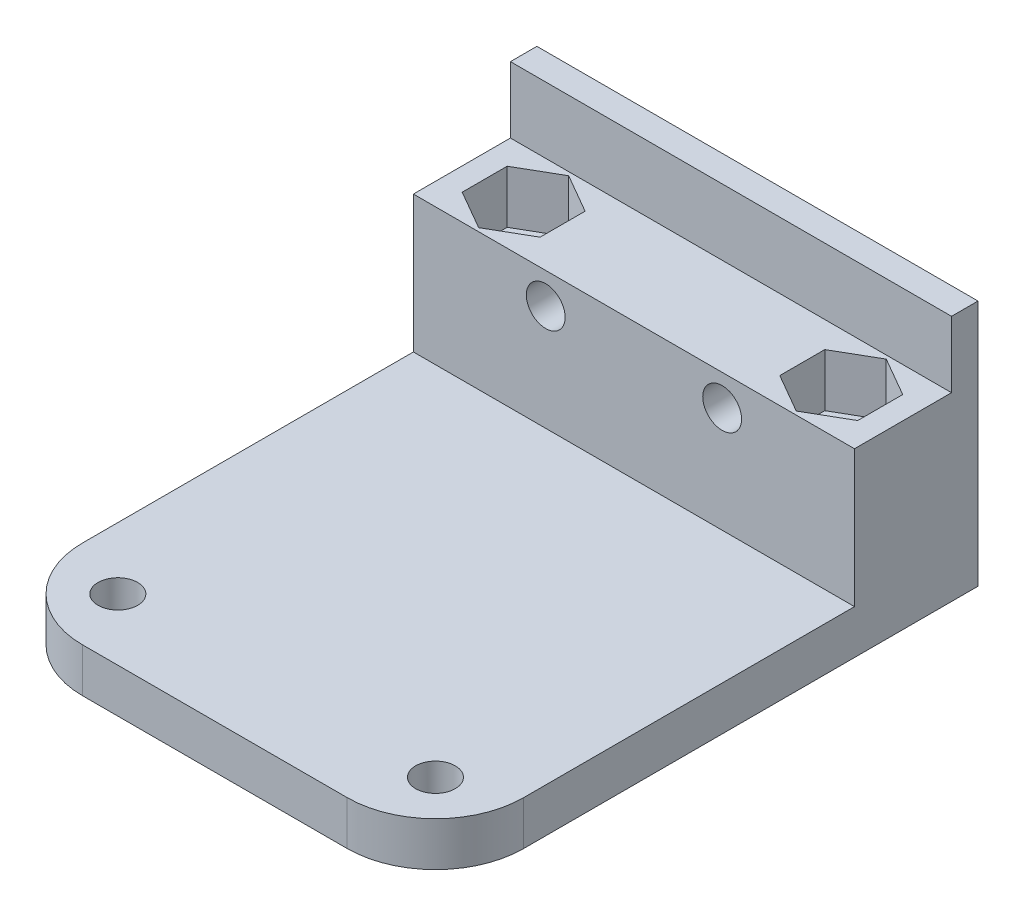
ISO-10303-21;
HEADER;
FILE_DESCRIPTION(('STEP AP214'),'2;1');
FILE_NAME('part.step','',(''),(''),'','','');
FILE_SCHEMA(('AUTOMOTIVE_DESIGN { 1 0 10303 214 1 1 1 1 }'));
ENDSEC;
DATA;
#1=APPLICATION_CONTEXT('core data for automotive mechanical design processes');
#2=APPLICATION_PROTOCOL_DEFINITION('international standard','automotive_design',2000,#1);
#3=PRODUCT_CONTEXT('',#1,'mechanical');
#4=PRODUCT('Part','Part','',(#3));
#5=PRODUCT_RELATED_PRODUCT_CATEGORY('part','',(#4));
#6=PRODUCT_DEFINITION_FORMATION('','',#4);
#7=PRODUCT_DEFINITION_CONTEXT('part definition',#1,'design');
#8=PRODUCT_DEFINITION('design','',#6,#7);
#9=PRODUCT_DEFINITION_SHAPE('','',#8);
#10=(LENGTH_UNIT() NAMED_UNIT(*) SI_UNIT(.MILLI.,.METRE.));
#11=(NAMED_UNIT(*) PLANE_ANGLE_UNIT() SI_UNIT($,.RADIAN.));
#12=(NAMED_UNIT(*) SI_UNIT($,.STERADIAN.) SOLID_ANGLE_UNIT());
#13=UNCERTAINTY_MEASURE_WITH_UNIT(LENGTH_MEASURE(1.E-05),#10,'distance_accuracy_value','');
#14=(GEOMETRIC_REPRESENTATION_CONTEXT(3) GLOBAL_UNCERTAINTY_ASSIGNED_CONTEXT((#13)) GLOBAL_UNIT_ASSIGNED_CONTEXT((#10,
#11,#12)) REPRESENTATION_CONTEXT('',''));
#15=CARTESIAN_POINT('',(0.,0.,0.));
#16=DIRECTION('',(0.,0.,1.));
#17=DIRECTION('',(1.,0.,0.));
#18=AXIS2_PLACEMENT_3D('',#15,#16,#17);
#19=CARTESIAN_POINT('',(-25.,-11.5,61.5));
#20=DIRECTION('',(0.,-1.,0.));
#21=DIRECTION('',(0.,0.,-1.));
#22=AXIS2_PLACEMENT_3D('',#19,#20,#21);
#23=PLANE('',#22);
#24=CARTESIAN_POINT('',(-18.,-11.5,54.5));
#25=DIRECTION('',(0.,-1.,0.));
#26=DIRECTION('',(0.,0.,-1.));
#27=AXIS2_PLACEMENT_3D('',#24,#25,#26);
#28=CIRCLE('',#27,2.2479);
#29=CARTESIAN_POINT('',(-18.,-11.5,52.2521));
#30=VERTEX_POINT('',#29);
#31=EDGE_CURVE('E257',#30,#30,#28,.T.);
#32=ORIENTED_EDGE('',*,*,#31,.T.);
#33=EDGE_LOOP('',(#32));
#34=FACE_BOUND('',#33,.T.);
#35=DIRECTION('',(-1.,0.,0.));
#36=VECTOR('',#35,1.);
#37=CARTESIAN_POINT('',(-25.,-11.5,61.5));
#38=LINE('',#37,#36);
#39=CARTESIAN_POINT('',(15.,-11.5,61.5));
#40=VERTEX_POINT('',#39);
#41=CARTESIAN_POINT('',(-15.,-11.5,61.5));
#42=VERTEX_POINT('',#41);
#43=EDGE_CURVE('E205',#40,#42,#38,.T.);
#44=ORIENTED_EDGE('',*,*,#43,.F.);
#45=CARTESIAN_POINT('',(15.,-11.5,51.5));
#46=DIRECTION('',(0.,-1.,0.));
#47=DIRECTION('',(0.,0.,-1.));
#48=AXIS2_PLACEMENT_3D('',#45,#46,#47);
#49=CIRCLE('',#48,10.);
#50=CARTESIAN_POINT('',(25.,-11.5,51.5));
#51=VERTEX_POINT('',#50);
#52=EDGE_CURVE('E53',#40,#51,#49,.F.);
#53=ORIENTED_EDGE('',*,*,#52,.T.);
#54=DIRECTION('',(0.,0.,-1.));
#55=VECTOR('',#54,1.);
#56=CARTESIAN_POINT('',(25.,-11.5,61.5));
#57=LINE('',#56,#55);
#58=CARTESIAN_POINT('',(25.,-11.5,14.));
#59=VERTEX_POINT('',#58);
#60=EDGE_CURVE('E215',#51,#59,#57,.T.);
#61=ORIENTED_EDGE('',*,*,#60,.T.);
#62=DIRECTION('',(1.,0.,0.));
#63=VECTOR('',#62,1.);
#64=CARTESIAN_POINT('',(-25.,-11.5,14.));
#65=LINE('',#64,#63);
#66=CARTESIAN_POINT('',(-25.,-11.5,14.));
#67=VERTEX_POINT('',#66);
#68=EDGE_CURVE('E307',#67,#59,#65,.T.);
#69=ORIENTED_EDGE('',*,*,#68,.F.);
#70=DIRECTION('',(0.,0.,-1.));
#71=VECTOR('',#70,1.);
#72=CARTESIAN_POINT('',(-25.,-11.5,61.5));
#73=LINE('',#72,#71);
#74=CARTESIAN_POINT('',(-25.,-11.5,51.5));
#75=VERTEX_POINT('',#74);
#76=EDGE_CURVE('E208',#75,#67,#73,.T.);
#77=ORIENTED_EDGE('',*,*,#76,.F.);
#78=CARTESIAN_POINT('',(-15.,-11.5,51.5));
#79=DIRECTION('',(0.,-1.,0.));
#80=DIRECTION('',(0.,0.,-1.));
#81=AXIS2_PLACEMENT_3D('',#78,#79,#80);
#82=CIRCLE('',#81,10.);
#83=EDGE_CURVE('E244',#75,#42,#82,.F.);
#84=ORIENTED_EDGE('',*,*,#83,.T.);
#85=EDGE_LOOP('',(#44,#53,#61,#69,#77,#84));
#86=FACE_BOUND('',#85,.T.);
#87=CARTESIAN_POINT('',(18.,-11.5,54.5));
#88=DIRECTION('',(0.,-1.,0.));
#89=DIRECTION('',(0.,0.,-1.));
#90=AXIS2_PLACEMENT_3D('',#87,#88,#89);
#91=CIRCLE('',#90,2.2479);
#92=CARTESIAN_POINT('',(18.,-11.5,52.2521));
#93=VERTEX_POINT('',#92);
#94=EDGE_CURVE('E260',#93,#93,#91,.T.);
#95=ORIENTED_EDGE('',*,*,#94,.T.);
#96=EDGE_LOOP('',(#95));
#97=FACE_BOUND('',#96,.T.);
#98=ADVANCED_FACE('F36',(#34,#86,#97),#23,.F.);
#99=CARTESIAN_POINT('',(-25.,16.5,3.));
#100=DIRECTION('',(1.,0.,0.));
#101=DIRECTION('',(0.,1.,0.));
#102=AXIS2_PLACEMENT_3D('',#99,#100,#101);
#103=PLANE('',#102);
#104=DIRECTION('',(0.,1.,0.));
#105=VECTOR('',#104,1.);
#106=CARTESIAN_POINT('',(-25.,-16.5,51.5));
#107=LINE('',#106,#105);
#108=CARTESIAN_POINT('',(-25.,-16.5,51.5));
#109=VERTEX_POINT('',#108);
#110=EDGE_CURVE('E240',#109,#75,#107,.T.);
#111=ORIENTED_EDGE('',*,*,#110,.T.);
#112=ORIENTED_EDGE('',*,*,#76,.T.);
#113=DIRECTION('',(0.,-1.,0.));
#114=VECTOR('',#113,1.);
#115=CARTESIAN_POINT('',(-25.,4.,14.));
#116=LINE('',#115,#114);
#117=CARTESIAN_POINT('',(-25.,4.,14.));
#118=VERTEX_POINT('',#117);
#119=EDGE_CURVE('E380',#118,#67,#116,.T.);
#120=ORIENTED_EDGE('',*,*,#119,.F.);
#121=DIRECTION('',(0.,0.,1.));
#122=VECTOR('',#121,1.);
#123=CARTESIAN_POINT('',(-25.,4.,3.));
#124=LINE('',#123,#122);
#125=CARTESIAN_POINT('',(-25.,4.,3.));
#126=VERTEX_POINT('',#125);
#127=EDGE_CURVE('E364',#126,#118,#124,.T.);
#128=ORIENTED_EDGE('',*,*,#127,.F.);
#129=DIRECTION('',(0.,-1.,0.));
#130=VECTOR('',#129,1.);
#131=CARTESIAN_POINT('',(-25.,16.5,3.));
#132=LINE('',#131,#130);
#133=CARTESIAN_POINT('',(-25.,11.5,3.));
#134=VERTEX_POINT('',#133);
#135=EDGE_CURVE('E221',#134,#126,#132,.T.);
#136=ORIENTED_EDGE('',*,*,#135,.F.);
#137=DIRECTION('',(0.,0.,1.));
#138=VECTOR('',#137,1.);
#139=CARTESIAN_POINT('',(-25.,11.5,-50.2493781056044));
#140=LINE('',#139,#138);
#141=CARTESIAN_POINT('',(-25.,11.5,0.));
#142=VERTEX_POINT('',#141);
#143=EDGE_CURVE('E206',#142,#134,#140,.T.);
#144=ORIENTED_EDGE('',*,*,#143,.F.);
#145=DIRECTION('',(0.,-1.,0.));
#146=VECTOR('',#145,1.);
#147=CARTESIAN_POINT('',(-25.,16.5,0.));
#148=LINE('',#147,#146);
#149=CARTESIAN_POINT('',(-25.,-16.5,0.));
#150=VERTEX_POINT('',#149);
#151=EDGE_CURVE('E222',#142,#150,#148,.T.);
#152=ORIENTED_EDGE('',*,*,#151,.T.);
#153=DIRECTION('',(0.,0.,-1.));
#154=VECTOR('',#153,1.);
#155=CARTESIAN_POINT('',(-25.,-16.5,3.));
#156=LINE('',#155,#154);
#157=EDGE_CURVE('E11',#109,#150,#156,.T.);
#158=ORIENTED_EDGE('',*,*,#157,.F.);
#159=EDGE_LOOP('',(#111,#112,#120,#128,#136,#144,#152,#158));
#160=FACE_BOUND('',#159,.T.);
#161=ADVANCED_FACE('F402',(#160),#103,.F.);
#162=CARTESIAN_POINT('',(-25.,-16.5,3.));
#163=DIRECTION('',(0.,1.,0.));
#164=DIRECTION('',(0.,0.,1.));
#165=AXIS2_PLACEMENT_3D('',#162,#163,#164);
#166=PLANE('',#165);
#167=CARTESIAN_POINT('',(18.,-16.5,54.5));
#168=DIRECTION('',(0.,1.,0.));
#169=DIRECTION('',(0.,0.,1.));
#170=AXIS2_PLACEMENT_3D('',#167,#168,#169);
#171=CIRCLE('',#170,2.2479);
#172=CARTESIAN_POINT('',(18.,-16.5,56.7479));
#173=VERTEX_POINT('',#172);
#174=EDGE_CURVE('E442',#173,#173,#171,.T.);
#175=ORIENTED_EDGE('',*,*,#174,.T.);
#176=EDGE_LOOP('',(#175));
#177=FACE_BOUND('',#176,.T.);
#178=DIRECTION('',(0.,0.,-1.));
#179=VECTOR('',#178,1.);
#180=CARTESIAN_POINT('',(25.,-16.5,3.));
#181=LINE('',#180,#179);
#182=CARTESIAN_POINT('',(25.,-16.5,51.5));
#183=VERTEX_POINT('',#182);
#184=CARTESIAN_POINT('',(25.,-16.5,0.));
#185=VERTEX_POINT('',#184);
#186=EDGE_CURVE('E45',#183,#185,#181,.T.);
#187=ORIENTED_EDGE('',*,*,#186,.F.);
#188=CARTESIAN_POINT('',(15.,-16.5,51.5));
#189=DIRECTION('',(0.,-1.,0.));
#190=DIRECTION('',(0.,0.,1.));
#191=AXIS2_PLACEMENT_3D('',#188,#189,#190);
#192=CIRCLE('',#191,10.);
#193=CARTESIAN_POINT('',(15.,-16.5,61.5));
#194=VERTEX_POINT('',#193);
#195=EDGE_CURVE('E186',#183,#194,#192,.T.);
#196=ORIENTED_EDGE('',*,*,#195,.T.);
#197=DIRECTION('',(1.,0.,0.));
#198=VECTOR('',#197,1.);
#199=CARTESIAN_POINT('',(-25.,-16.5,61.5));
#200=LINE('',#199,#198);
#201=CARTESIAN_POINT('',(-15.,-16.5,61.5));
#202=VERTEX_POINT('',#201);
#203=EDGE_CURVE('E199',#202,#194,#200,.T.);
#204=ORIENTED_EDGE('',*,*,#203,.F.);
#205=CARTESIAN_POINT('',(-15.,-16.5,51.5));
#206=DIRECTION('',(0.,-1.,0.));
#207=DIRECTION('',(0.,0.,1.));
#208=AXIS2_PLACEMENT_3D('',#205,#206,#207);
#209=CIRCLE('',#208,10.);
#210=EDGE_CURVE('E61',#202,#109,#209,.T.);
#211=ORIENTED_EDGE('',*,*,#210,.T.);
#212=ORIENTED_EDGE('',*,*,#157,.T.);
#213=DIRECTION('',(1.,0.,0.));
#214=VECTOR('',#213,1.);
#215=CARTESIAN_POINT('',(-25.,-16.5,0.));
#216=LINE('',#215,#214);
#217=EDGE_CURVE('E226',#150,#185,#216,.T.);
#218=ORIENTED_EDGE('',*,*,#217,.T.);
#219=EDGE_LOOP('',(#187,#196,#204,#211,#212,#218));
#220=FACE_BOUND('',#219,.T.);
#221=CARTESIAN_POINT('',(18.,-16.5,8.50000000000002));
#222=DIRECTION('',(0.,1.,0.));
#223=DIRECTION('',(0.,0.,1.));
#224=AXIS2_PLACEMENT_3D('',#221,#222,#223);
#225=CIRCLE('',#224,2.2479);
#226=CARTESIAN_POINT('',(18.,-16.5,10.7479));
#227=VERTEX_POINT('',#226);
#228=EDGE_CURVE('E448',#227,#227,#225,.T.);
#229=ORIENTED_EDGE('',*,*,#228,.T.);
#230=EDGE_LOOP('',(#229));
#231=FACE_BOUND('',#230,.T.);
#232=CARTESIAN_POINT('',(-18.,-16.5,54.5));
#233=DIRECTION('',(0.,1.,0.));
#234=DIRECTION('',(0.,0.,1.));
#235=AXIS2_PLACEMENT_3D('',#232,#233,#234);
#236=CIRCLE('',#235,2.2479);
#237=CARTESIAN_POINT('',(-18.,-16.5,56.7479));
#238=VERTEX_POINT('',#237);
#239=EDGE_CURVE('E201',#238,#238,#236,.T.);
#240=ORIENTED_EDGE('',*,*,#239,.T.);
#241=EDGE_LOOP('',(#240));
#242=FACE_BOUND('',#241,.T.);
#243=CARTESIAN_POINT('',(-18.,-16.5,8.50000000000002));
#244=DIRECTION('',(0.,1.,0.));
#245=DIRECTION('',(0.,0.,1.));
#246=AXIS2_PLACEMENT_3D('',#243,#244,#245);
#247=CIRCLE('',#246,2.2479);
#248=CARTESIAN_POINT('',(-18.,-16.5,10.7479));
#249=VERTEX_POINT('',#248);
#250=EDGE_CURVE('E444',#249,#249,#247,.T.);
#251=ORIENTED_EDGE('',*,*,#250,.T.);
#252=EDGE_LOOP('',(#251));
#253=FACE_BOUND('',#252,.T.);
#254=ADVANCED_FACE('F197',(#177,#220,#231,#242,#253),#166,.F.);
#255=CARTESIAN_POINT('',(25.,16.5,3.));
#256=DIRECTION('',(1.,0.,0.));
#257=DIRECTION('',(0.,1.,0.));
#258=AXIS2_PLACEMENT_3D('',#255,#256,#257);
#259=PLANE('',#258);
#260=ORIENTED_EDGE('',*,*,#60,.F.);
#261=DIRECTION('',(0.,1.,0.));
#262=VECTOR('',#261,1.);
#263=CARTESIAN_POINT('',(25.,-16.5,51.5));
#264=LINE('',#263,#262);
#265=EDGE_CURVE('E192',#183,#51,#264,.T.);
#266=ORIENTED_EDGE('',*,*,#265,.F.);
#267=ORIENTED_EDGE('',*,*,#186,.T.);
#268=DIRECTION('',(0.,-1.,0.));
#269=VECTOR('',#268,1.);
#270=CARTESIAN_POINT('',(25.,16.5,0.));
#271=LINE('',#270,#269);
#272=CARTESIAN_POINT('',(25.,11.5,0.));
#273=VERTEX_POINT('',#272);
#274=EDGE_CURVE('E217',#273,#185,#271,.T.);
#275=ORIENTED_EDGE('',*,*,#274,.F.);
#276=DIRECTION('',(0.,0.,1.));
#277=VECTOR('',#276,1.);
#278=CARTESIAN_POINT('',(25.,11.5,-50.2493781056044));
#279=LINE('',#278,#277);
#280=CARTESIAN_POINT('',(25.,11.5,3.));
#281=VERTEX_POINT('',#280);
#282=EDGE_CURVE('E210',#273,#281,#279,.T.);
#283=ORIENTED_EDGE('',*,*,#282,.T.);
#284=DIRECTION('',(0.,-1.,0.));
#285=VECTOR('',#284,1.);
#286=CARTESIAN_POINT('',(25.,16.5,3.));
#287=LINE('',#286,#285);
#288=CARTESIAN_POINT('',(25.,4.,3.));
#289=VERTEX_POINT('',#288);
#290=EDGE_CURVE('E218',#281,#289,#287,.T.);
#291=ORIENTED_EDGE('',*,*,#290,.T.);
#292=DIRECTION('',(0.,0.,-1.));
#293=VECTOR('',#292,1.);
#294=CARTESIAN_POINT('',(25.,4.,3.));
#295=LINE('',#294,#293);
#296=CARTESIAN_POINT('',(25.,4.,14.));
#297=VERTEX_POINT('',#296);
#298=EDGE_CURVE('E369',#297,#289,#295,.T.);
#299=ORIENTED_EDGE('',*,*,#298,.F.);
#300=DIRECTION('',(0.,-1.,0.));
#301=VECTOR('',#300,1.);
#302=CARTESIAN_POINT('',(25.,4.,14.));
#303=LINE('',#302,#301);
#304=EDGE_CURVE('E375',#297,#59,#303,.T.);
#305=ORIENTED_EDGE('',*,*,#304,.T.);
#306=EDGE_LOOP('',(#260,#266,#267,#275,#283,#291,#299,#305));
#307=FACE_BOUND('',#306,.T.);
#308=ADVANCED_FACE('F38',(#307),#259,.T.);
#309=CARTESIAN_POINT('',(0.,0.,61.5));
#310=DIRECTION('',(0.,0.,-1.));
#311=DIRECTION('',(-1.,0.,0.));
#312=AXIS2_PLACEMENT_3D('',#309,#310,#311);
#313=PLANE('',#312);
#314=DIRECTION('',(0.,1.,0.));
#315=VECTOR('',#314,1.);
#316=CARTESIAN_POINT('',(15.,-16.5,61.5));
#317=LINE('',#316,#315);
#318=EDGE_CURVE('E183',#194,#40,#317,.T.);
#319=ORIENTED_EDGE('',*,*,#318,.T.);
#320=ORIENTED_EDGE('',*,*,#43,.T.);
#321=DIRECTION('',(0.,1.,0.));
#322=VECTOR('',#321,1.);
#323=CARTESIAN_POINT('',(-15.,-16.5,61.5));
#324=LINE('',#323,#322);
#325=EDGE_CURVE('E204',#202,#42,#324,.T.);
#326=ORIENTED_EDGE('',*,*,#325,.F.);
#327=ORIENTED_EDGE('',*,*,#203,.T.);
#328=EDGE_LOOP('',(#319,#320,#326,#327));
#329=FACE_BOUND('',#328,.T.);
#330=ADVANCED_FACE('F203',(#329),#313,.F.);
#331=CARTESIAN_POINT('',(0.,0.,3.));
#332=DIRECTION('',(0.,0.,-1.));
#333=DIRECTION('',(-1.,0.,0.));
#334=AXIS2_PLACEMENT_3D('',#331,#332,#333);
#335=PLANE('',#334);
#336=ORIENTED_EDGE('',*,*,#135,.T.);
#337=DIRECTION('',(-1.,0.,0.));
#338=VECTOR('',#337,1.);
#339=CARTESIAN_POINT('',(-25.,4.,3.));
#340=LINE('',#339,#338);
#341=EDGE_CURVE('E372',#289,#126,#340,.T.);
#342=ORIENTED_EDGE('',*,*,#341,.F.);
#343=ORIENTED_EDGE('',*,*,#290,.F.);
#344=DIRECTION('',(1.,0.,0.));
#345=VECTOR('',#344,1.);
#346=CARTESIAN_POINT('',(-25.,11.5,3.));
#347=LINE('',#346,#345);
#348=EDGE_CURVE('E383',#134,#281,#347,.T.);
#349=ORIENTED_EDGE('',*,*,#348,.F.);
#350=EDGE_LOOP('',(#336,#342,#343,#349));
#351=FACE_BOUND('',#350,.T.);
#352=ADVANCED_FACE('F396',(#351),#335,.F.);
#353=CARTESIAN_POINT('',(0.,0.,0.));
#354=DIRECTION('',(0.,0.,-1.));
#355=DIRECTION('',(-1.,0.,0.));
#356=AXIS2_PLACEMENT_3D('',#353,#354,#355);
#357=PLANE('',#356);
#358=DIRECTION('',(1.,0.,0.));
#359=VECTOR('',#358,1.);
#360=CARTESIAN_POINT('',(-25.,11.5,0.));
#361=LINE('',#360,#359);
#362=EDGE_CURVE('E385',#142,#273,#361,.T.);
#363=ORIENTED_EDGE('',*,*,#362,.T.);
#364=ORIENTED_EDGE('',*,*,#274,.T.);
#365=ORIENTED_EDGE('',*,*,#217,.F.);
#366=ORIENTED_EDGE('',*,*,#151,.F.);
#367=EDGE_LOOP('',(#363,#364,#365,#366));
#368=FACE_BOUND('',#367,.T.);
#369=ADVANCED_FACE('F414',(#368),#357,.T.);
#370=CARTESIAN_POINT('',(-25.,11.5,-50.2493781056044));
#371=DIRECTION('',(0.,-1.,0.));
#372=DIRECTION('',(0.,0.,-1.));
#373=AXIS2_PLACEMENT_3D('',#370,#371,#372);
#374=PLANE('',#373);
#375=ORIENTED_EDGE('',*,*,#143,.T.);
#376=ORIENTED_EDGE('',*,*,#348,.T.);
#377=ORIENTED_EDGE('',*,*,#282,.F.);
#378=ORIENTED_EDGE('',*,*,#362,.F.);
#379=EDGE_LOOP('',(#375,#376,#377,#378));
#380=FACE_BOUND('',#379,.T.);
#381=ADVANCED_FACE('F415',(#380),#374,.F.);
#382=CARTESIAN_POINT('',(-25.,4.,14.));
#383=DIRECTION('',(0.,0.,-1.));
#384=DIRECTION('',(-1.,0.,0.));
#385=AXIS2_PLACEMENT_3D('',#382,#383,#384);
#386=PLANE('',#385);
#387=CARTESIAN_POINT('',(-10.000570113924,0.499999999999719,14.));
#388=DIRECTION('',(0.,0.,-1.));
#389=DIRECTION('',(-1.,0.,0.));
#390=AXIS2_PLACEMENT_3D('',#387,#388,#389);
#391=CIRCLE('',#390,2.2);
#392=CARTESIAN_POINT('',(-12.200570113924,0.499999999999719,14.));
#393=VERTEX_POINT('',#392);
#394=EDGE_CURVE('E234',#393,#393,#391,.F.);
#395=ORIENTED_EDGE('',*,*,#394,.F.);
#396=EDGE_LOOP('',(#395));
#397=FACE_BOUND('',#396,.T.);
#398=CARTESIAN_POINT('',(9.99942988607603,0.499999999999718,14.));
#399=DIRECTION('',(0.,0.,-1.));
#400=DIRECTION('',(-1.,0.,0.));
#401=AXIS2_PLACEMENT_3D('',#398,#399,#400);
#402=CIRCLE('',#401,2.2);
#403=CARTESIAN_POINT('',(7.79942988607602,0.499999999999718,14.));
#404=VERTEX_POINT('',#403);
#405=EDGE_CURVE('E231',#404,#404,#402,.F.);
#406=ORIENTED_EDGE('',*,*,#405,.F.);
#407=EDGE_LOOP('',(#406));
#408=FACE_BOUND('',#407,.T.);
#409=ORIENTED_EDGE('',*,*,#68,.T.);
#410=ORIENTED_EDGE('',*,*,#304,.F.);
#411=DIRECTION('',(1.,0.,0.));
#412=VECTOR('',#411,1.);
#413=CARTESIAN_POINT('',(-25.,4.,14.));
#414=LINE('',#413,#412);
#415=EDGE_CURVE('E367',#118,#297,#414,.T.);
#416=ORIENTED_EDGE('',*,*,#415,.F.);
#417=ORIENTED_EDGE('',*,*,#119,.T.);
#418=EDGE_LOOP('',(#409,#410,#416,#417));
#419=FACE_BOUND('',#418,.T.);
#420=ADVANCED_FACE('F406',(#397,#408,#419),#386,.F.);
#421=CARTESIAN_POINT('',(0.,4.,0.));
#422=DIRECTION('',(0.,1.,0.));
#423=DIRECTION('',(0.,0.,1.));
#424=AXIS2_PLACEMENT_3D('',#421,#422,#423);
#425=PLANE('',#424);
#426=DIRECTION('',(-0.866025403784439,0.,-0.499999999999999));
#427=VECTOR('',#426,1.);
#428=CARTESIAN_POINT('',(-13.5832704406994,4.,5.95000000000001));
#429=LINE('',#428,#427);
#430=CARTESIAN_POINT('',(-13.5832704406994,4.,5.95000000000001));
#431=VERTEX_POINT('',#430);
#432=CARTESIAN_POINT('',(-18.,4.,3.40000000000002));
#433=VERTEX_POINT('',#432);
#434=EDGE_CURVE('E288',#431,#433,#429,.T.);
#435=ORIENTED_EDGE('',*,*,#434,.F.);
#436=DIRECTION('',(0.,0.,-1.));
#437=VECTOR('',#436,1.);
#438=CARTESIAN_POINT('',(-13.5832704406994,4.,11.05));
#439=LINE('',#438,#437);
#440=CARTESIAN_POINT('',(-13.5832704406994,4.,11.05));
#441=VERTEX_POINT('',#440);
#442=EDGE_CURVE('E272',#441,#431,#439,.T.);
#443=ORIENTED_EDGE('',*,*,#442,.F.);
#444=DIRECTION('',(0.866025403784438,0.,-0.500000000000001));
#445=VECTOR('',#444,1.);
#446=CARTESIAN_POINT('',(-18.,4.,13.6));
#447=LINE('',#446,#445);
#448=CARTESIAN_POINT('',(-18.,4.,13.6));
#449=VERTEX_POINT('',#448);
#450=EDGE_CURVE('E300',#449,#441,#447,.T.);
#451=ORIENTED_EDGE('',*,*,#450,.F.);
#452=DIRECTION('',(0.866025403784439,0.,0.5));
#453=VECTOR('',#452,1.);
#454=CARTESIAN_POINT('',(-22.4167295593006,4.,11.05));
#455=LINE('',#454,#453);
#456=CARTESIAN_POINT('',(-22.4167295593006,4.,11.05));
#457=VERTEX_POINT('',#456);
#458=EDGE_CURVE('E297',#457,#449,#455,.T.);
#459=ORIENTED_EDGE('',*,*,#458,.F.);
#460=DIRECTION('',(0.,0.,1.));
#461=VECTOR('',#460,1.);
#462=CARTESIAN_POINT('',(-22.4167295593007,4.,5.95000000000003));
#463=LINE('',#462,#461);
#464=CARTESIAN_POINT('',(-22.4167295593007,4.,5.95000000000003));
#465=VERTEX_POINT('',#464);
#466=EDGE_CURVE('E294',#465,#457,#463,.T.);
#467=ORIENTED_EDGE('',*,*,#466,.F.);
#468=DIRECTION('',(-0.866025403784438,0.,0.500000000000001));
#469=VECTOR('',#468,1.);
#470=CARTESIAN_POINT('',(-18.,4.,3.40000000000002));
#471=LINE('',#470,#469);
#472=EDGE_CURVE('E290',#433,#465,#471,.T.);
#473=ORIENTED_EDGE('',*,*,#472,.F.);
#474=EDGE_LOOP('',(#435,#443,#451,#459,#467,#473));
#475=FACE_BOUND('',#474,.T.);
#476=DIRECTION('',(0.,0.,1.));
#477=VECTOR('',#476,1.);
#478=CARTESIAN_POINT('',(13.5832704406994,4.,11.05));
#479=LINE('',#478,#477);
#480=CARTESIAN_POINT('',(13.5832704406994,4.,5.95000000000003));
#481=VERTEX_POINT('',#480);
#482=CARTESIAN_POINT('',(13.5832704406994,4.,11.05));
#483=VERTEX_POINT('',#482);
#484=EDGE_CURVE('E237',#481,#483,#479,.T.);
#485=ORIENTED_EDGE('',*,*,#484,.F.);
#486=DIRECTION('',(-0.866025403784438,0.,0.5));
#487=VECTOR('',#486,1.);
#488=CARTESIAN_POINT('',(13.5832704406994,4.,5.95000000000003));
#489=LINE('',#488,#487);
#490=CARTESIAN_POINT('',(18.,4.,3.40000000000004));
#491=VERTEX_POINT('',#490);
#492=EDGE_CURVE('E322',#491,#481,#489,.T.);
#493=ORIENTED_EDGE('',*,*,#492,.F.);
#494=DIRECTION('',(-0.866025403784439,0.,-0.5));
#495=VECTOR('',#494,1.);
#496=CARTESIAN_POINT('',(18.,4.,3.40000000000004));
#497=LINE('',#496,#495);
#498=CARTESIAN_POINT('',(22.4167295593007,4.,5.95000000000003));
#499=VERTEX_POINT('',#498);
#500=EDGE_CURVE('E348',#499,#491,#497,.T.);
#501=ORIENTED_EDGE('',*,*,#500,.F.);
#502=DIRECTION('',(0.,0.,-1.));
#503=VECTOR('',#502,1.);
#504=CARTESIAN_POINT('',(22.4167295593007,4.,5.95000000000003));
#505=LINE('',#504,#503);
#506=CARTESIAN_POINT('',(22.4167295593007,4.,11.05));
#507=VERTEX_POINT('',#506);
#508=EDGE_CURVE('E345',#507,#499,#505,.T.);
#509=ORIENTED_EDGE('',*,*,#508,.F.);
#510=DIRECTION('',(0.866025403784439,0.,-0.499999999999999));
#511=VECTOR('',#510,1.);
#512=CARTESIAN_POINT('',(22.4167295593007,4.,11.05));
#513=LINE('',#512,#511);
#514=CARTESIAN_POINT('',(18.,4.,13.6));
#515=VERTEX_POINT('',#514);
#516=EDGE_CURVE('E342',#515,#507,#513,.T.);
#517=ORIENTED_EDGE('',*,*,#516,.F.);
#518=DIRECTION('',(0.866025403784439,0.,0.5));
#519=VECTOR('',#518,1.);
#520=CARTESIAN_POINT('',(18.,4.,13.6));
#521=LINE('',#520,#519);
#522=EDGE_CURVE('E339',#483,#515,#521,.T.);
#523=ORIENTED_EDGE('',*,*,#522,.F.);
#524=EDGE_LOOP('',(#485,#493,#501,#509,#517,#523));
#525=FACE_BOUND('',#524,.T.);
#526=ORIENTED_EDGE('',*,*,#127,.T.);
#527=ORIENTED_EDGE('',*,*,#415,.T.);
#528=ORIENTED_EDGE('',*,*,#298,.T.);
#529=ORIENTED_EDGE('',*,*,#341,.T.);
#530=EDGE_LOOP('',(#526,#527,#528,#529));
#531=FACE_BOUND('',#530,.T.);
#532=ADVANCED_FACE('F400',(#475,#525,#531),#425,.T.);
#533=CARTESIAN_POINT('',(13.5832704406994,-2.,11.05));
#534=DIRECTION('',(-1.,0.,0.));
#535=DIRECTION('',(0.,0.,1.));
#536=AXIS2_PLACEMENT_3D('',#533,#534,#535);
#537=PLANE('',#536);
#538=ORIENTED_EDGE('',*,*,#484,.T.);
#539=DIRECTION('',(0.,1.,0.));
#540=VECTOR('',#539,1.);
#541=CARTESIAN_POINT('',(13.5832704406994,-2.,11.05));
#542=LINE('',#541,#540);
#543=CARTESIAN_POINT('',(13.5832704406994,-2.,11.05));
#544=VERTEX_POINT('',#543);
#545=EDGE_CURVE('E337',#544,#483,#542,.T.);
#546=ORIENTED_EDGE('',*,*,#545,.F.);
#547=DIRECTION('',(0.,0.,1.));
#548=VECTOR('',#547,1.);
#549=CARTESIAN_POINT('',(13.5832704406994,-2.,11.05));
#550=LINE('',#549,#548);
#551=CARTESIAN_POINT('',(13.5832704406994,-2.,5.95000000000003));
#552=VERTEX_POINT('',#551);
#553=EDGE_CURVE('E318',#552,#544,#550,.T.);
#554=ORIENTED_EDGE('',*,*,#553,.F.);
#555=DIRECTION('',(0.,1.,0.));
#556=VECTOR('',#555,1.);
#557=CARTESIAN_POINT('',(13.5832704406994,-2.,5.95000000000003));
#558=LINE('',#557,#556);
#559=EDGE_CURVE('E291',#552,#481,#558,.T.);
#560=ORIENTED_EDGE('',*,*,#559,.T.);
#561=EDGE_LOOP('',(#538,#546,#554,#560));
#562=FACE_BOUND('',#561,.T.);
#563=ADVANCED_FACE('F473',(#562),#537,.F.);
#564=CARTESIAN_POINT('',(13.5832704406994,-2.,5.95000000000003));
#565=DIRECTION('',(-0.5,0.,-0.866025403784438));
#566=DIRECTION('',(-0.866025403784439,0.,0.5));
#567=AXIS2_PLACEMENT_3D('',#564,#565,#566);
#568=PLANE('',#567);
#569=ORIENTED_EDGE('',*,*,#492,.T.);
#570=ORIENTED_EDGE('',*,*,#559,.F.);
#571=DIRECTION('',(-0.866025403784438,0.,0.5));
#572=VECTOR('',#571,1.);
#573=CARTESIAN_POINT('',(13.5832704406994,-2.,5.95000000000003));
#574=LINE('',#573,#572);
#575=CARTESIAN_POINT('',(18.,-2.,3.40000000000004));
#576=VERTEX_POINT('',#575);
#577=EDGE_CURVE('E334',#576,#552,#574,.T.);
#578=ORIENTED_EDGE('',*,*,#577,.F.);
#579=DIRECTION('',(0.,1.,0.));
#580=VECTOR('',#579,1.);
#581=CARTESIAN_POINT('',(18.,-2.,3.40000000000004));
#582=LINE('',#581,#580);
#583=EDGE_CURVE('E354',#576,#491,#582,.T.);
#584=ORIENTED_EDGE('',*,*,#583,.T.);
#585=EDGE_LOOP('',(#569,#570,#578,#584));
#586=FACE_BOUND('',#585,.T.);
#587=ADVANCED_FACE('F491',(#586),#568,.F.);
#588=CARTESIAN_POINT('',(18.,-2.,3.40000000000004));
#589=DIRECTION('',(0.5,0.,-0.866025403784439));
#590=DIRECTION('',(-0.866025403784439,0.,-0.5));
#591=AXIS2_PLACEMENT_3D('',#588,#589,#590);
#592=PLANE('',#591);
#593=ORIENTED_EDGE('',*,*,#500,.T.);
#594=ORIENTED_EDGE('',*,*,#583,.F.);
#595=DIRECTION('',(-0.866025403784439,0.,-0.5));
#596=VECTOR('',#595,1.);
#597=CARTESIAN_POINT('',(18.,-2.,3.40000000000004));
#598=LINE('',#597,#596);
#599=CARTESIAN_POINT('',(22.4167295593007,-2.,5.95000000000003));
#600=VERTEX_POINT('',#599);
#601=EDGE_CURVE('E331',#600,#576,#598,.T.);
#602=ORIENTED_EDGE('',*,*,#601,.F.);
#603=DIRECTION('',(0.,1.,0.));
#604=VECTOR('',#603,1.);
#605=CARTESIAN_POINT('',(22.4167295593007,-2.,5.95000000000003));
#606=LINE('',#605,#604);
#607=EDGE_CURVE('E356',#600,#499,#606,.T.);
#608=ORIENTED_EDGE('',*,*,#607,.T.);
#609=EDGE_LOOP('',(#593,#594,#602,#608));
#610=FACE_BOUND('',#609,.T.);
#611=ADVANCED_FACE('F488',(#610),#592,.F.);
#612=CARTESIAN_POINT('',(22.4167295593007,-2.,5.95000000000003));
#613=DIRECTION('',(1.,0.,0.));
#614=DIRECTION('',(0.,0.,-1.));
#615=AXIS2_PLACEMENT_3D('',#612,#613,#614);
#616=PLANE('',#615);
#617=ORIENTED_EDGE('',*,*,#508,.T.);
#618=ORIENTED_EDGE('',*,*,#607,.F.);
#619=DIRECTION('',(0.,0.,-1.));
#620=VECTOR('',#619,1.);
#621=CARTESIAN_POINT('',(22.4167295593007,-2.,5.95000000000003));
#622=LINE('',#621,#620);
#623=CARTESIAN_POINT('',(22.4167295593007,-2.,11.05));
#624=VERTEX_POINT('',#623);
#625=EDGE_CURVE('E328',#624,#600,#622,.T.);
#626=ORIENTED_EDGE('',*,*,#625,.F.);
#627=DIRECTION('',(0.,1.,0.));
#628=VECTOR('',#627,1.);
#629=CARTESIAN_POINT('',(22.4167295593007,-2.,11.05));
#630=LINE('',#629,#628);
#631=EDGE_CURVE('E358',#624,#507,#630,.T.);
#632=ORIENTED_EDGE('',*,*,#631,.T.);
#633=EDGE_LOOP('',(#617,#618,#626,#632));
#634=FACE_BOUND('',#633,.T.);
#635=ADVANCED_FACE('F484',(#634),#616,.F.);
#636=CARTESIAN_POINT('',(22.4167295593007,-2.,11.05));
#637=DIRECTION('',(0.5,0.,0.866025403784439));
#638=DIRECTION('',(0.866025403784439,0.,-0.5));
#639=AXIS2_PLACEMENT_3D('',#636,#637,#638);
#640=PLANE('',#639);
#641=ORIENTED_EDGE('',*,*,#516,.T.);
#642=ORIENTED_EDGE('',*,*,#631,.F.);
#643=DIRECTION('',(0.866025403784439,0.,-0.499999999999999));
#644=VECTOR('',#643,1.);
#645=CARTESIAN_POINT('',(22.4167295593007,-2.,11.05));
#646=LINE('',#645,#644);
#647=CARTESIAN_POINT('',(18.,-2.,13.6));
#648=VERTEX_POINT('',#647);
#649=EDGE_CURVE('E325',#648,#624,#646,.T.);
#650=ORIENTED_EDGE('',*,*,#649,.F.);
#651=DIRECTION('',(0.,1.,0.));
#652=VECTOR('',#651,1.);
#653=CARTESIAN_POINT('',(18.,-2.,13.6));
#654=LINE('',#653,#652);
#655=EDGE_CURVE('E360',#648,#515,#654,.T.);
#656=ORIENTED_EDGE('',*,*,#655,.T.);
#657=EDGE_LOOP('',(#641,#642,#650,#656));
#658=FACE_BOUND('',#657,.T.);
#659=ADVANCED_FACE('F480',(#658),#640,.F.);
#660=CARTESIAN_POINT('',(18.,-2.,13.6));
#661=DIRECTION('',(-0.5,0.,0.866025403784439));
#662=DIRECTION('',(0.866025403784439,0.,0.5));
#663=AXIS2_PLACEMENT_3D('',#660,#661,#662);
#664=PLANE('',#663);
#665=ORIENTED_EDGE('',*,*,#522,.T.);
#666=ORIENTED_EDGE('',*,*,#655,.F.);
#667=DIRECTION('',(0.866025403784439,0.,0.5));
#668=VECTOR('',#667,1.);
#669=CARTESIAN_POINT('',(18.,-2.,13.6));
#670=LINE('',#669,#668);
#671=EDGE_CURVE('E321',#544,#648,#670,.T.);
#672=ORIENTED_EDGE('',*,*,#671,.F.);
#673=ORIENTED_EDGE('',*,*,#545,.T.);
#674=EDGE_LOOP('',(#665,#666,#672,#673));
#675=FACE_BOUND('',#674,.T.);
#676=ADVANCED_FACE('F467',(#675),#664,.F.);
#677=CARTESIAN_POINT('',(0.,-2.,0.));
#678=DIRECTION('',(0.,-1.,0.));
#679=DIRECTION('',(0.,0.,-1.));
#680=AXIS2_PLACEMENT_3D('',#677,#678,#679);
#681=PLANE('',#680);
#682=CARTESIAN_POINT('',(18.,-2.,8.50000000000002));
#683=DIRECTION('',(0.,-1.,0.));
#684=DIRECTION('',(0.,0.,-1.));
#685=AXIS2_PLACEMENT_3D('',#682,#683,#684);
#686=CIRCLE('',#685,2.2479);
#687=CARTESIAN_POINT('',(18.,-2.,6.25210000000003));
#688=VERTEX_POINT('',#687);
#689=EDGE_CURVE('E40',#688,#688,#686,.T.);
#690=ORIENTED_EDGE('',*,*,#689,.T.);
#691=EDGE_LOOP('',(#690));
#692=FACE_BOUND('',#691,.T.);
#693=ORIENTED_EDGE('',*,*,#553,.T.);
#694=ORIENTED_EDGE('',*,*,#671,.T.);
#695=ORIENTED_EDGE('',*,*,#649,.T.);
#696=ORIENTED_EDGE('',*,*,#625,.T.);
#697=ORIENTED_EDGE('',*,*,#601,.T.);
#698=ORIENTED_EDGE('',*,*,#577,.T.);
#699=EDGE_LOOP('',(#693,#694,#695,#696,#697,#698));
#700=FACE_BOUND('',#699,.T.);
#701=ADVANCED_FACE('F463',(#692,#700),#681,.F.);
#702=CARTESIAN_POINT('',(-13.5832704406994,-2.,5.95000000000001));
#703=DIRECTION('',(0.499999999999999,0.,-0.866025403784439));
#704=DIRECTION('',(-0.866025403784439,0.,-0.499999999999999));
#705=AXIS2_PLACEMENT_3D('',#702,#703,#704);
#706=PLANE('',#705);
#707=ORIENTED_EDGE('',*,*,#434,.T.);
#708=DIRECTION('',(0.,1.,0.));
#709=VECTOR('',#708,1.);
#710=CARTESIAN_POINT('',(-18.,-2.,3.40000000000002));
#711=LINE('',#710,#709);
#712=CARTESIAN_POINT('',(-18.,-2.,3.40000000000002));
#713=VERTEX_POINT('',#712);
#714=EDGE_CURVE('E287',#713,#433,#711,.T.);
#715=ORIENTED_EDGE('',*,*,#714,.F.);
#716=DIRECTION('',(-0.866025403784439,0.,-0.499999999999999));
#717=VECTOR('',#716,1.);
#718=CARTESIAN_POINT('',(-13.5832704406994,-2.,5.95000000000001));
#719=LINE('',#718,#717);
#720=CARTESIAN_POINT('',(-13.5832704406994,-2.,5.95000000000001));
#721=VERTEX_POINT('',#720);
#722=EDGE_CURVE('E268',#721,#713,#719,.T.);
#723=ORIENTED_EDGE('',*,*,#722,.F.);
#724=DIRECTION('',(0.,1.,0.));
#725=VECTOR('',#724,1.);
#726=CARTESIAN_POINT('',(-13.5832704406994,-2.,5.95000000000001));
#727=LINE('',#726,#725);
#728=EDGE_CURVE('E305',#721,#431,#727,.T.);
#729=ORIENTED_EDGE('',*,*,#728,.T.);
#730=EDGE_LOOP('',(#707,#715,#723,#729));
#731=FACE_BOUND('',#730,.T.);
#732=ADVANCED_FACE('F466',(#731),#706,.F.);
#733=CARTESIAN_POINT('',(-13.5832704406994,-2.,11.05));
#734=DIRECTION('',(1.,0.,0.));
#735=DIRECTION('',(0.,0.,-1.));
#736=AXIS2_PLACEMENT_3D('',#733,#734,#735);
#737=PLANE('',#736);
#738=ORIENTED_EDGE('',*,*,#442,.T.);
#739=ORIENTED_EDGE('',*,*,#728,.F.);
#740=DIRECTION('',(0.,0.,-1.));
#741=VECTOR('',#740,1.);
#742=CARTESIAN_POINT('',(-13.5832704406994,-2.,11.05));
#743=LINE('',#742,#741);
#744=CARTESIAN_POINT('',(-13.5832704406994,-2.,11.05));
#745=VERTEX_POINT('',#744);
#746=EDGE_CURVE('E284',#745,#721,#743,.T.);
#747=ORIENTED_EDGE('',*,*,#746,.F.);
#748=DIRECTION('',(0.,1.,0.));
#749=VECTOR('',#748,1.);
#750=CARTESIAN_POINT('',(-13.5832704406994,-2.,11.05));
#751=LINE('',#750,#749);
#752=EDGE_CURVE('E308',#745,#441,#751,.T.);
#753=ORIENTED_EDGE('',*,*,#752,.T.);
#754=EDGE_LOOP('',(#738,#739,#747,#753));
#755=FACE_BOUND('',#754,.T.);
#756=ADVANCED_FACE('F514',(#755),#737,.F.);
#757=CARTESIAN_POINT('',(-18.,-2.,13.6));
#758=DIRECTION('',(0.500000000000001,0.,0.866025403784438));
#759=DIRECTION('',(0.866025403784438,0.,-0.500000000000001));
#760=AXIS2_PLACEMENT_3D('',#757,#758,#759);
#761=PLANE('',#760);
#762=ORIENTED_EDGE('',*,*,#450,.T.);
#763=ORIENTED_EDGE('',*,*,#752,.F.);
#764=DIRECTION('',(0.866025403784438,0.,-0.500000000000001));
#765=VECTOR('',#764,1.);
#766=CARTESIAN_POINT('',(-18.,-2.,13.6));
#767=LINE('',#766,#765);
#768=CARTESIAN_POINT('',(-18.,-2.,13.6));
#769=VERTEX_POINT('',#768);
#770=EDGE_CURVE('E281',#769,#745,#767,.T.);
#771=ORIENTED_EDGE('',*,*,#770,.F.);
#772=DIRECTION('',(0.,1.,0.));
#773=VECTOR('',#772,1.);
#774=CARTESIAN_POINT('',(-18.,-2.,13.6));
#775=LINE('',#774,#773);
#776=EDGE_CURVE('E310',#769,#449,#775,.T.);
#777=ORIENTED_EDGE('',*,*,#776,.T.);
#778=EDGE_LOOP('',(#762,#763,#771,#777));
#779=FACE_BOUND('',#778,.T.);
#780=ADVANCED_FACE('F528',(#779),#761,.F.);
#781=CARTESIAN_POINT('',(-22.4167295593006,-2.,11.05));
#782=DIRECTION('',(-0.5,0.,0.866025403784439));
#783=DIRECTION('',(0.866025403784439,0.,0.5));
#784=AXIS2_PLACEMENT_3D('',#781,#782,#783);
#785=PLANE('',#784);
#786=ORIENTED_EDGE('',*,*,#458,.T.);
#787=ORIENTED_EDGE('',*,*,#776,.F.);
#788=DIRECTION('',(0.866025403784439,0.,0.5));
#789=VECTOR('',#788,1.);
#790=CARTESIAN_POINT('',(-22.4167295593006,-2.,11.05));
#791=LINE('',#790,#789);
#792=CARTESIAN_POINT('',(-22.4167295593006,-2.,11.05));
#793=VERTEX_POINT('',#792);
#794=EDGE_CURVE('E278',#793,#769,#791,.T.);
#795=ORIENTED_EDGE('',*,*,#794,.F.);
#796=DIRECTION('',(0.,1.,0.));
#797=VECTOR('',#796,1.);
#798=CARTESIAN_POINT('',(-22.4167295593006,-2.,11.05));
#799=LINE('',#798,#797);
#800=EDGE_CURVE('E312',#793,#457,#799,.T.);
#801=ORIENTED_EDGE('',*,*,#800,.T.);
#802=EDGE_LOOP('',(#786,#787,#795,#801));
#803=FACE_BOUND('',#802,.T.);
#804=ADVANCED_FACE('F524',(#803),#785,.F.);
#805=CARTESIAN_POINT('',(-22.4167295593007,-2.,5.95000000000003));
#806=DIRECTION('',(-1.,0.,0.));
#807=DIRECTION('',(0.,0.,1.));
#808=AXIS2_PLACEMENT_3D('',#805,#806,#807);
#809=PLANE('',#808);
#810=ORIENTED_EDGE('',*,*,#466,.T.);
#811=ORIENTED_EDGE('',*,*,#800,.F.);
#812=DIRECTION('',(0.,0.,1.));
#813=VECTOR('',#812,1.);
#814=CARTESIAN_POINT('',(-22.4167295593007,-2.,5.95000000000003));
#815=LINE('',#814,#813);
#816=CARTESIAN_POINT('',(-22.4167295593007,-2.,5.95000000000003));
#817=VERTEX_POINT('',#816);
#818=EDGE_CURVE('E275',#817,#793,#815,.T.);
#819=ORIENTED_EDGE('',*,*,#818,.F.);
#820=DIRECTION('',(0.,1.,0.));
#821=VECTOR('',#820,1.);
#822=CARTESIAN_POINT('',(-22.4167295593007,-2.,5.95000000000003));
#823=LINE('',#822,#821);
#824=EDGE_CURVE('E314',#817,#465,#823,.T.);
#825=ORIENTED_EDGE('',*,*,#824,.T.);
#826=EDGE_LOOP('',(#810,#811,#819,#825));
#827=FACE_BOUND('',#826,.T.);
#828=ADVANCED_FACE('F520',(#827),#809,.F.);
#829=CARTESIAN_POINT('',(-18.,-2.,3.40000000000002));
#830=DIRECTION('',(-0.500000000000001,0.,-0.866025403784438));
#831=DIRECTION('',(-0.866025403784438,0.,0.500000000000001));
#832=AXIS2_PLACEMENT_3D('',#829,#830,#831);
#833=PLANE('',#832);
#834=ORIENTED_EDGE('',*,*,#472,.T.);
#835=ORIENTED_EDGE('',*,*,#824,.F.);
#836=DIRECTION('',(-0.866025403784438,0.,0.500000000000001));
#837=VECTOR('',#836,1.);
#838=CARTESIAN_POINT('',(-18.,-2.,3.40000000000002));
#839=LINE('',#838,#837);
#840=EDGE_CURVE('E271',#713,#817,#839,.T.);
#841=ORIENTED_EDGE('',*,*,#840,.F.);
#842=ORIENTED_EDGE('',*,*,#714,.T.);
#843=EDGE_LOOP('',(#834,#835,#841,#842));
#844=FACE_BOUND('',#843,.T.);
#845=ADVANCED_FACE('F516',(#844),#833,.F.);
#846=CARTESIAN_POINT('',(0.,-2.,0.));
#847=DIRECTION('',(0.,1.,0.));
#848=DIRECTION('',(0.,0.,1.));
#849=AXIS2_PLACEMENT_3D('',#846,#847,#848);
#850=PLANE('',#849);
#851=CARTESIAN_POINT('',(-18.,-2.,8.50000000000002));
#852=DIRECTION('',(0.,1.,0.));
#853=DIRECTION('',(0.,0.,1.));
#854=AXIS2_PLACEMENT_3D('',#851,#852,#853);
#855=CIRCLE('',#854,2.2479);
#856=CARTESIAN_POINT('',(-18.,-2.,10.7479));
#857=VERTEX_POINT('',#856);
#858=EDGE_CURVE('E238',#857,#857,#855,.T.);
#859=ORIENTED_EDGE('',*,*,#858,.F.);
#860=EDGE_LOOP('',(#859));
#861=FACE_BOUND('',#860,.T.);
#862=ORIENTED_EDGE('',*,*,#722,.T.);
#863=ORIENTED_EDGE('',*,*,#840,.T.);
#864=ORIENTED_EDGE('',*,*,#818,.T.);
#865=ORIENTED_EDGE('',*,*,#794,.T.);
#866=ORIENTED_EDGE('',*,*,#770,.T.);
#867=ORIENTED_EDGE('',*,*,#746,.T.);
#868=EDGE_LOOP('',(#862,#863,#864,#865,#866,#867));
#869=FACE_BOUND('',#868,.T.);
#870=ADVANCED_FACE('F519',(#861,#869),#850,.T.);
#871=CARTESIAN_POINT('',(9.99942988607603,0.499999999999718,61.5));
#872=DIRECTION('',(0.,0.,-1.));
#873=DIRECTION('',(-1.,0.,0.));
#874=AXIS2_PLACEMENT_3D('',#871,#872,#873);
#875=CYLINDRICAL_SURFACE('',#874,2.2);
#876=CARTESIAN_POINT('',(9.99942988607603,0.499999999999718,3.));
#877=DIRECTION('',(0.,0.,1.));
#878=DIRECTION('',(1.,0.,0.));
#879=AXIS2_PLACEMENT_3D('',#876,#877,#878);
#880=CIRCLE('',#879,2.2);
#881=CARTESIAN_POINT('',(12.199429886076,0.499999999999718,3.));
#882=VERTEX_POINT('',#881);
#883=EDGE_CURVE('E263',#882,#882,#880,.T.);
#884=ORIENTED_EDGE('',*,*,#883,.F.);
#885=EDGE_LOOP('',(#884));
#886=FACE_BOUND('',#885,.T.);
#887=ORIENTED_EDGE('',*,*,#405,.T.);
#888=EDGE_LOOP('',(#887));
#889=FACE_BOUND('',#888,.T.);
#890=ADVANCED_FACE('F538',(#886,#889),#875,.F.);
#891=CARTESIAN_POINT('',(9.99942988607603,0.499999999999718,3.));
#892=DIRECTION('',(0.,0.,1.));
#893=DIRECTION('',(1.,0.,0.));
#894=AXIS2_PLACEMENT_3D('',#891,#892,#893);
#895=PLANE('',#894);
#896=ORIENTED_EDGE('',*,*,#883,.T.);
#897=EDGE_LOOP('',(#896));
#898=FACE_BOUND('',#897,.T.);
#899=ADVANCED_FACE('F542',(#898),#895,.T.);
#900=CARTESIAN_POINT('',(-10.000570113924,0.499999999999719,61.5));
#901=DIRECTION('',(0.,0.,-1.));
#902=DIRECTION('',(-1.,0.,0.));
#903=AXIS2_PLACEMENT_3D('',#900,#901,#902);
#904=CYLINDRICAL_SURFACE('',#903,2.2);
#905=CARTESIAN_POINT('',(-10.000570113924,0.499999999999719,3.));
#906=DIRECTION('',(0.,0.,1.));
#907=DIRECTION('',(1.,0.,0.));
#908=AXIS2_PLACEMENT_3D('',#905,#906,#907);
#909=CIRCLE('',#908,2.2);
#910=CARTESIAN_POINT('',(-7.80057011392399,0.499999999999719,3.));
#911=VERTEX_POINT('',#910);
#912=EDGE_CURVE('E235',#911,#911,#909,.T.);
#913=ORIENTED_EDGE('',*,*,#912,.F.);
#914=EDGE_LOOP('',(#913));
#915=FACE_BOUND('',#914,.T.);
#916=ORIENTED_EDGE('',*,*,#394,.T.);
#917=EDGE_LOOP('',(#916));
#918=FACE_BOUND('',#917,.T.);
#919=ADVANCED_FACE('F546',(#915,#918),#904,.F.);
#920=CARTESIAN_POINT('',(-10.000570113924,0.499999999999719,3.));
#921=DIRECTION('',(0.,0.,1.));
#922=DIRECTION('',(1.,0.,0.));
#923=AXIS2_PLACEMENT_3D('',#920,#921,#922);
#924=PLANE('',#923);
#925=ORIENTED_EDGE('',*,*,#912,.T.);
#926=EDGE_LOOP('',(#925));
#927=FACE_BOUND('',#926,.T.);
#928=ADVANCED_FACE('F550',(#927),#924,.T.);
#929=CARTESIAN_POINT('',(-18.,-16.5,8.50000000000002));
#930=DIRECTION('',(0.,1.,0.));
#931=DIRECTION('',(0.,0.,1.));
#932=AXIS2_PLACEMENT_3D('',#929,#930,#931);
#933=CYLINDRICAL_SURFACE('',#932,2.2479);
#934=ORIENTED_EDGE('',*,*,#858,.T.);
#935=EDGE_LOOP('',(#934));
#936=FACE_BOUND('',#935,.T.);
#937=ORIENTED_EDGE('',*,*,#250,.F.);
#938=EDGE_LOOP('',(#937));
#939=FACE_BOUND('',#938,.T.);
#940=ADVANCED_FACE('F459',(#936,#939),#933,.F.);
#941=CARTESIAN_POINT('',(18.,-16.5,8.50000000000002));
#942=DIRECTION('',(0.,1.,0.));
#943=DIRECTION('',(0.,0.,1.));
#944=AXIS2_PLACEMENT_3D('',#941,#942,#943);
#945=CYLINDRICAL_SURFACE('',#944,2.2479);
#946=ORIENTED_EDGE('',*,*,#228,.F.);
#947=EDGE_LOOP('',(#946));
#948=FACE_BOUND('',#947,.T.);
#949=ORIENTED_EDGE('',*,*,#689,.F.);
#950=EDGE_LOOP('',(#949));
#951=FACE_BOUND('',#950,.T.);
#952=ADVANCED_FACE('F456',(#948,#951),#945,.F.);
#953=CARTESIAN_POINT('',(-15.,-16.5,51.5));
#954=DIRECTION('',(0.,1.,0.));
#955=DIRECTION('',(0.,0.,1.));
#956=AXIS2_PLACEMENT_3D('',#953,#954,#955);
#957=CYLINDRICAL_SURFACE('',#956,10.);
#958=ORIENTED_EDGE('',*,*,#110,.F.);
#959=ORIENTED_EDGE('',*,*,#210,.F.);
#960=ORIENTED_EDGE('',*,*,#325,.T.);
#961=ORIENTED_EDGE('',*,*,#83,.F.);
#962=EDGE_LOOP('',(#958,#959,#960,#961));
#963=FACE_BOUND('',#962,.T.);
#964=ADVANCED_FACE('F410',(#963),#957,.T.);
#965=CARTESIAN_POINT('',(15.,-16.5,51.5));
#966=DIRECTION('',(0.,1.,0.));
#967=DIRECTION('',(0.,0.,1.));
#968=AXIS2_PLACEMENT_3D('',#965,#966,#967);
#969=CYLINDRICAL_SURFACE('',#968,10.);
#970=ORIENTED_EDGE('',*,*,#318,.F.);
#971=ORIENTED_EDGE('',*,*,#195,.F.);
#972=ORIENTED_EDGE('',*,*,#265,.T.);
#973=ORIENTED_EDGE('',*,*,#52,.F.);
#974=EDGE_LOOP('',(#970,#971,#972,#973));
#975=FACE_BOUND('',#974,.T.);
#976=ADVANCED_FACE('F185',(#975),#969,.T.);
#977=CARTESIAN_POINT('',(-18.,-16.5,54.5));
#978=DIRECTION('',(0.,1.,0.));
#979=DIRECTION('',(0.,0.,1.));
#980=AXIS2_PLACEMENT_3D('',#977,#978,#979);
#981=CYLINDRICAL_SURFACE('',#980,2.2479);
#982=ORIENTED_EDGE('',*,*,#239,.F.);
#983=EDGE_LOOP('',(#982));
#984=FACE_BOUND('',#983,.T.);
#985=ORIENTED_EDGE('',*,*,#31,.F.);
#986=EDGE_LOOP('',(#985));
#987=FACE_BOUND('',#986,.T.);
#988=ADVANCED_FACE('F557',(#984,#987),#981,.F.);
#989=CARTESIAN_POINT('',(18.,-16.5,54.5));
#990=DIRECTION('',(0.,1.,0.));
#991=DIRECTION('',(0.,0.,1.));
#992=AXIS2_PLACEMENT_3D('',#989,#990,#991);
#993=CYLINDRICAL_SURFACE('',#992,2.2479);
#994=ORIENTED_EDGE('',*,*,#174,.F.);
#995=EDGE_LOOP('',(#994));
#996=FACE_BOUND('',#995,.T.);
#997=ORIENTED_EDGE('',*,*,#94,.F.);
#998=EDGE_LOOP('',(#997));
#999=FACE_BOUND('',#998,.T.);
#1000=ADVANCED_FACE('F560',(#996,#999),#993,.F.);
#1001=CLOSED_SHELL('',(#98,#161,#254,#308,#330,#352,#369,#381,#420,#532,#563,#587,#611,#635,
#659,#676,#701,#732,#756,#780,#804,#828,#845,#870,#890,#899,#919,#928,#940,#952,#964,#976,#988,#1000));
#1002=MANIFOLD_SOLID_BREP('B2',#1001);
#1003=ADVANCED_BREP_SHAPE_REPRESENTATION('',(#18,#1002),#14);
#1004=SHAPE_DEFINITION_REPRESENTATION(#9,#1003);
ENDSEC;
END-ISO-10303-21;
